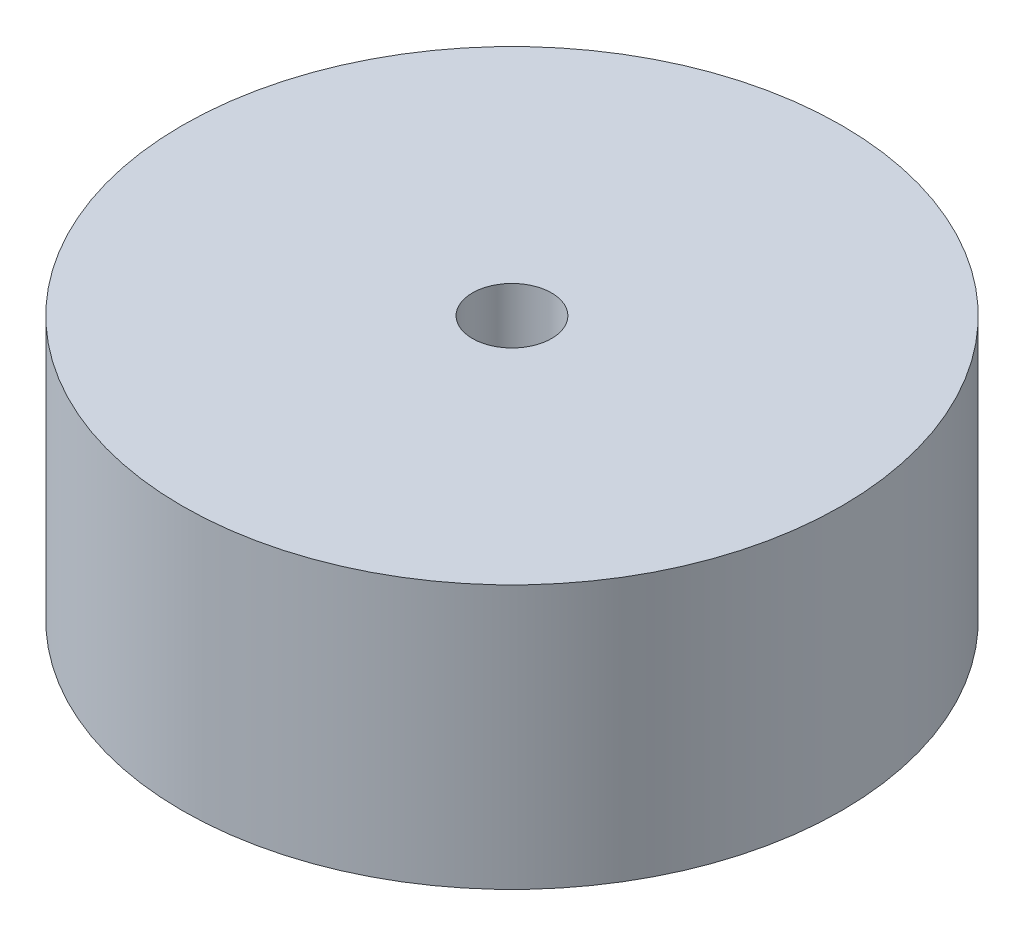
ISO-10303-21;
HEADER;
FILE_DESCRIPTION(('STEP AP214'),'2;1');
FILE_NAME('part.step','',(''),(''),'','','');
FILE_SCHEMA(('AUTOMOTIVE_DESIGN { 1 0 10303 214 1 1 1 1 }'));
ENDSEC;
DATA;
#1=APPLICATION_CONTEXT('core data for automotive mechanical design processes');
#2=APPLICATION_PROTOCOL_DEFINITION('international standard','automotive_design',2000,#1);
#3=PRODUCT_CONTEXT('',#1,'mechanical');
#4=PRODUCT('Part','Part','',(#3));
#5=PRODUCT_RELATED_PRODUCT_CATEGORY('part','',(#4));
#6=PRODUCT_DEFINITION_FORMATION('','',#4);
#7=PRODUCT_DEFINITION_CONTEXT('part definition',#1,'design');
#8=PRODUCT_DEFINITION('design','',#6,#7);
#9=PRODUCT_DEFINITION_SHAPE('','',#8);
#10=(LENGTH_UNIT() NAMED_UNIT(*) SI_UNIT(.MILLI.,.METRE.));
#11=(NAMED_UNIT(*) PLANE_ANGLE_UNIT() SI_UNIT($,.RADIAN.));
#12=(NAMED_UNIT(*) SI_UNIT($,.STERADIAN.) SOLID_ANGLE_UNIT());
#13=UNCERTAINTY_MEASURE_WITH_UNIT(LENGTH_MEASURE(1.E-05),#10,'distance_accuracy_value','');
#14=(GEOMETRIC_REPRESENTATION_CONTEXT(3) GLOBAL_UNCERTAINTY_ASSIGNED_CONTEXT((#13)) GLOBAL_UNIT_ASSIGNED_CONTEXT((#10,
#11,#12)) REPRESENTATION_CONTEXT('',''));
#15=CARTESIAN_POINT('',(0.,0.,0.));
#16=DIRECTION('',(0.,0.,1.));
#17=DIRECTION('',(1.,0.,0.));
#18=AXIS2_PLACEMENT_3D('',#15,#16,#17);
#19=CARTESIAN_POINT('',(0.,20.32,0.));
#20=DIRECTION('',(0.,1.,0.));
#21=DIRECTION('',(0.,0.,1.));
#22=AXIS2_PLACEMENT_3D('',#19,#20,#21);
#23=PLANE('',#22);
#24=CARTESIAN_POINT('',(0.,20.32,0.));
#25=DIRECTION('',(0.,1.,0.));
#26=DIRECTION('',(0.,0.,1.));
#27=AXIS2_PLACEMENT_3D('',#24,#25,#26);
#28=CIRCLE('',#27,25.4);
#29=CARTESIAN_POINT('',(0.,20.32,25.4));
#30=VERTEX_POINT('',#29);
#31=EDGE_CURVE('E10',#30,#30,#28,.T.);
#32=ORIENTED_EDGE('',*,*,#31,.T.);
#33=EDGE_LOOP('',(#32));
#34=FACE_BOUND('',#33,.T.);
#35=CARTESIAN_POINT('',(0.,20.32,0.));
#36=DIRECTION('',(0.,1.,0.));
#37=DIRECTION('',(0.,0.,1.));
#38=AXIS2_PLACEMENT_3D('',#35,#36,#37);
#39=CIRCLE('',#38,3.048);
#40=CARTESIAN_POINT('',(0.,20.32,3.048));
#41=VERTEX_POINT('',#40);
#42=EDGE_CURVE('E51',#41,#41,#39,.T.);
#43=ORIENTED_EDGE('',*,*,#42,.F.);
#44=EDGE_LOOP('',(#43));
#45=FACE_BOUND('',#44,.T.);
#46=ADVANCED_FACE('F40',(#34,#45),#23,.T.);
#47=CARTESIAN_POINT('',(0.,0.,0.));
#48=DIRECTION('',(0.,1.,0.));
#49=DIRECTION('',(0.,0.,1.));
#50=AXIS2_PLACEMENT_3D('',#47,#48,#49);
#51=PLANE('',#50);
#52=CARTESIAN_POINT('',(0.,0.,0.));
#53=DIRECTION('',(0.,1.,0.));
#54=DIRECTION('',(0.,0.,1.));
#55=AXIS2_PLACEMENT_3D('',#52,#53,#54);
#56=CIRCLE('',#55,25.4);
#57=CARTESIAN_POINT('',(0.,0.,25.4));
#58=VERTEX_POINT('',#57);
#59=EDGE_CURVE('E44',#58,#58,#56,.T.);
#60=ORIENTED_EDGE('',*,*,#59,.F.);
#61=EDGE_LOOP('',(#60));
#62=FACE_BOUND('',#61,.T.);
#63=CARTESIAN_POINT('',(0.,0.,0.));
#64=DIRECTION('',(0.,1.,0.));
#65=DIRECTION('',(0.,0.,1.));
#66=AXIS2_PLACEMENT_3D('',#63,#64,#65);
#67=CIRCLE('',#66,3.048);
#68=CARTESIAN_POINT('',(0.,0.,3.048));
#69=VERTEX_POINT('',#68);
#70=EDGE_CURVE('E53',#69,#69,#67,.T.);
#71=ORIENTED_EDGE('',*,*,#70,.T.);
#72=EDGE_LOOP('',(#71));
#73=FACE_BOUND('',#72,.T.);
#74=ADVANCED_FACE('F63',(#62,#73),#51,.F.);
#75=CARTESIAN_POINT('',(0.,20.32,0.));
#76=DIRECTION('',(0.,-1.,0.));
#77=DIRECTION('',(0.,0.,-1.));
#78=AXIS2_PLACEMENT_3D('',#75,#76,#77);
#79=CYLINDRICAL_SURFACE('',#78,25.4);
#80=ORIENTED_EDGE('',*,*,#31,.F.);
#81=EDGE_LOOP('',(#80));
#82=FACE_BOUND('',#81,.T.);
#83=ORIENTED_EDGE('',*,*,#59,.T.);
#84=EDGE_LOOP('',(#83));
#85=FACE_BOUND('',#84,.T.);
#86=ADVANCED_FACE('F42',(#82,#85),#79,.T.);
#87=CARTESIAN_POINT('',(0.,20.32,0.));
#88=DIRECTION('',(0.,-1.,0.));
#89=DIRECTION('',(0.,0.,-1.));
#90=AXIS2_PLACEMENT_3D('',#87,#88,#89);
#91=CYLINDRICAL_SURFACE('',#90,3.048);
#92=ORIENTED_EDGE('',*,*,#42,.T.);
#93=EDGE_LOOP('',(#92));
#94=FACE_BOUND('',#93,.T.);
#95=ORIENTED_EDGE('',*,*,#70,.F.);
#96=EDGE_LOOP('',(#95));
#97=FACE_BOUND('',#96,.T.);
#98=ADVANCED_FACE('F59',(#94,#97),#91,.F.);
#99=CLOSED_SHELL('',(#46,#74,#86,#98));
#100=MANIFOLD_SOLID_BREP('B2',#99);
#101=ADVANCED_BREP_SHAPE_REPRESENTATION('',(#18,#100),#14);
#102=SHAPE_DEFINITION_REPRESENTATION(#9,#101);
ENDSEC;
END-ISO-10303-21;
